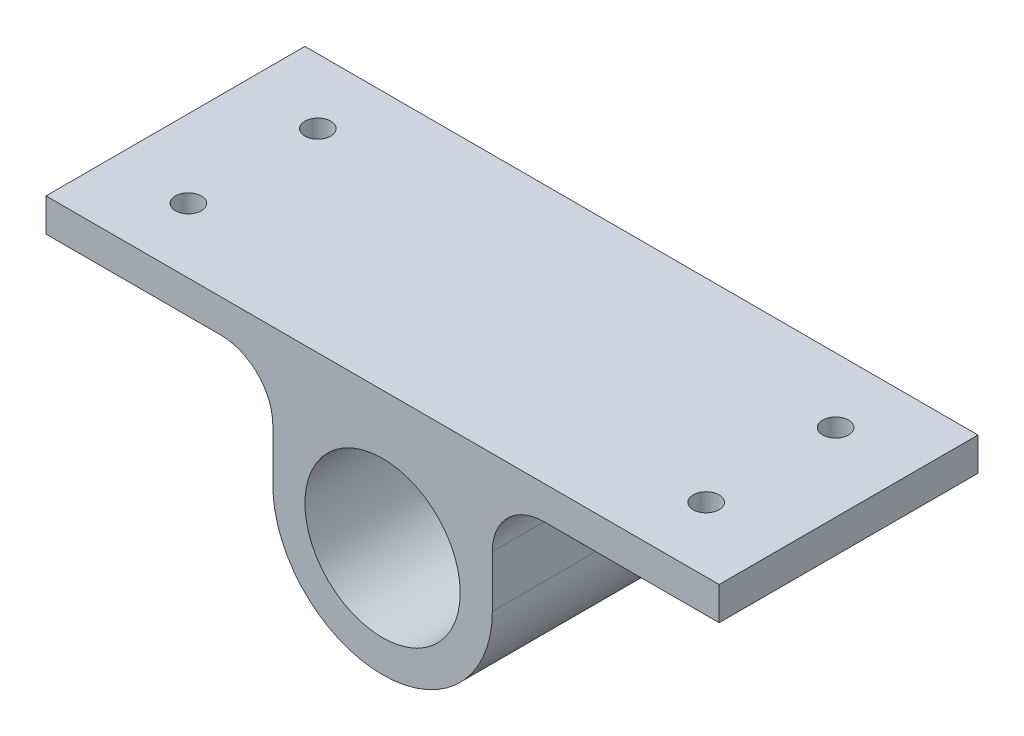
ISO-10303-21;
HEADER;
FILE_DESCRIPTION(('STEP AP214'),'2;1');
FILE_NAME('part.step','',(''),(''),'','','');
FILE_SCHEMA(('AUTOMOTIVE_DESIGN { 1 0 10303 214 1 1 1 1 }'));
ENDSEC;
DATA;
#1=APPLICATION_CONTEXT('core data for automotive mechanical design processes');
#2=APPLICATION_PROTOCOL_DEFINITION('international standard','automotive_design',2000,#1);
#3=PRODUCT_CONTEXT('',#1,'mechanical');
#4=PRODUCT('Part','Part','',(#3));
#5=PRODUCT_RELATED_PRODUCT_CATEGORY('part','',(#4));
#6=PRODUCT_DEFINITION_FORMATION('','',#4);
#7=PRODUCT_DEFINITION_CONTEXT('part definition',#1,'design');
#8=PRODUCT_DEFINITION('design','',#6,#7);
#9=PRODUCT_DEFINITION_SHAPE('','',#8);
#10=(LENGTH_UNIT() NAMED_UNIT(*) SI_UNIT(.MILLI.,.METRE.));
#11=(NAMED_UNIT(*) PLANE_ANGLE_UNIT() SI_UNIT($,.RADIAN.));
#12=(NAMED_UNIT(*) SI_UNIT($,.STERADIAN.) SOLID_ANGLE_UNIT());
#13=UNCERTAINTY_MEASURE_WITH_UNIT(LENGTH_MEASURE(1.E-05),#10,'distance_accuracy_value','');
#14=(GEOMETRIC_REPRESENTATION_CONTEXT(3) GLOBAL_UNCERTAINTY_ASSIGNED_CONTEXT((#13)) GLOBAL_UNIT_ASSIGNED_CONTEXT((#10,
#11,#12)) REPRESENTATION_CONTEXT('',''));
#15=CARTESIAN_POINT('',(0.,0.,0.));
#16=DIRECTION('',(0.,0.,1.));
#17=DIRECTION('',(1.,0.,0.));
#18=AXIS2_PLACEMENT_3D('',#15,#16,#17);
#19=CARTESIAN_POINT('',(-156.,50.,250.));
#20=DIRECTION('',(0.,0.,-1.));
#21=DIRECTION('',(-1.,0.,0.));
#22=AXIS2_PLACEMENT_3D('',#19,#20,#21);
#23=PLANE('',#22);
#24=DIRECTION('',(0.,-1.,0.));
#25=VECTOR('',#24,1.);
#26=CARTESIAN_POINT('',(-325.,132.,250.));
#27=LINE('',#26,#25);
#28=CARTESIAN_POINT('',(-325.,132.,250.));
#29=VERTEX_POINT('',#28);
#30=CARTESIAN_POINT('',(-325.,100.,250.));
#31=VERTEX_POINT('',#30);
#32=EDGE_CURVE('E165',#29,#31,#27,.T.);
#33=ORIENTED_EDGE('',*,*,#32,.T.);
#34=DIRECTION('',(1.,0.,0.));
#35=VECTOR('',#34,1.);
#36=CARTESIAN_POINT('',(-325.,100.,250.));
#37=LINE('',#36,#35);
#38=CARTESIAN_POINT('',(-156.,100.,250.));
#39=VERTEX_POINT('',#38);
#40=EDGE_CURVE('E103',#31,#39,#37,.T.);
#41=ORIENTED_EDGE('',*,*,#40,.T.);
#42=CARTESIAN_POINT('',(-156.,50.,250.));
#43=DIRECTION('',(0.,0.,-1.));
#44=DIRECTION('',(-1.,0.,0.));
#45=AXIS2_PLACEMENT_3D('',#42,#43,#44);
#46=CIRCLE('',#45,50.);
#47=CARTESIAN_POINT('',(-106.,49.9999999999997,250.));
#48=VERTEX_POINT('',#47);
#49=EDGE_CURVE('E186',#39,#48,#46,.T.);
#50=ORIENTED_EDGE('',*,*,#49,.T.);
#51=DIRECTION('',(0.,-1.,0.));
#52=VECTOR('',#51,1.);
#53=CARTESIAN_POINT('',(-106.,49.9999999999997,250.));
#54=LINE('',#53,#52);
#55=CARTESIAN_POINT('',(-106.,0.,250.));
#56=VERTEX_POINT('',#55);
#57=EDGE_CURVE('E205',#48,#56,#54,.T.);
#58=ORIENTED_EDGE('',*,*,#57,.T.);
#59=CARTESIAN_POINT('',(0.,0.,250.));
#60=DIRECTION('',(0.,0.,1.));
#61=DIRECTION('',(1.,0.,0.));
#62=AXIS2_PLACEMENT_3D('',#59,#60,#61);
#63=CIRCLE('',#62,106.);
#64=CARTESIAN_POINT('',(106.,0.,250.));
#65=VERTEX_POINT('',#64);
#66=EDGE_CURVE('E202',#56,#65,#63,.T.);
#67=ORIENTED_EDGE('',*,*,#66,.T.);
#68=DIRECTION('',(0.,1.,0.));
#69=VECTOR('',#68,1.);
#70=CARTESIAN_POINT('',(106.,49.9999999999996,250.));
#71=LINE('',#70,#69);
#72=CARTESIAN_POINT('',(106.,49.9999999999996,250.));
#73=VERTEX_POINT('',#72);
#74=EDGE_CURVE('E204',#65,#73,#71,.T.);
#75=ORIENTED_EDGE('',*,*,#74,.T.);
#76=CARTESIAN_POINT('',(156.,50.,250.));
#77=DIRECTION('',(0.,0.,-1.));
#78=DIRECTION('',(1.,0.,0.));
#79=AXIS2_PLACEMENT_3D('',#76,#77,#78);
#80=CIRCLE('',#79,50.);
#81=CARTESIAN_POINT('',(156.,100.,250.));
#82=VERTEX_POINT('',#81);
#83=EDGE_CURVE('E128',#73,#82,#80,.T.);
#84=ORIENTED_EDGE('',*,*,#83,.T.);
#85=DIRECTION('',(1.,0.,0.));
#86=VECTOR('',#85,1.);
#87=CARTESIAN_POINT('',(325.,100.,250.));
#88=LINE('',#87,#86);
#89=CARTESIAN_POINT('',(325.,100.,250.));
#90=VERTEX_POINT('',#89);
#91=EDGE_CURVE('E122',#82,#90,#88,.T.);
#92=ORIENTED_EDGE('',*,*,#91,.T.);
#93=DIRECTION('',(0.,1.,0.));
#94=VECTOR('',#93,1.);
#95=CARTESIAN_POINT('',(325.,132.,250.));
#96=LINE('',#95,#94);
#97=CARTESIAN_POINT('',(325.,132.,250.));
#98=VERTEX_POINT('',#97);
#99=EDGE_CURVE('E126',#90,#98,#96,.T.);
#100=ORIENTED_EDGE('',*,*,#99,.T.);
#101=DIRECTION('',(-1.,0.,0.));
#102=VECTOR('',#101,1.);
#103=CARTESIAN_POINT('',(-325.,132.,250.));
#104=LINE('',#103,#102);
#105=EDGE_CURVE('E54',#98,#29,#104,.T.);
#106=ORIENTED_EDGE('',*,*,#105,.T.);
#107=EDGE_LOOP('',(#33,#41,#50,#58,#67,#75,#84,#92,#100,#106));
#108=FACE_BOUND('',#107,.T.);
#109=CARTESIAN_POINT('',(0.,0.,250.));
#110=DIRECTION('',(0.,0.,1.));
#111=DIRECTION('',(1.,0.,0.));
#112=AXIS2_PLACEMENT_3D('',#109,#110,#111);
#113=CIRCLE('',#112,75.);
#114=CARTESIAN_POINT('',(75.,0.,250.));
#115=VERTEX_POINT('',#114);
#116=EDGE_CURVE('E150',#115,#115,#113,.T.);
#117=ORIENTED_EDGE('',*,*,#116,.F.);
#118=EDGE_LOOP('',(#117));
#119=FACE_BOUND('',#118,.T.);
#120=ADVANCED_FACE('F37',(#108,#119),#23,.F.);
#121=CARTESIAN_POINT('',(-156.,50.,0.));
#122=DIRECTION('',(0.,0.,-1.));
#123=DIRECTION('',(-1.,0.,0.));
#124=AXIS2_PLACEMENT_3D('',#121,#122,#123);
#125=PLANE('',#124);
#126=DIRECTION('',(0.,-1.,0.));
#127=VECTOR('',#126,1.);
#128=CARTESIAN_POINT('',(-325.,132.,0.));
#129=LINE('',#128,#127);
#130=CARTESIAN_POINT('',(-325.,132.,0.));
#131=VERTEX_POINT('',#130);
#132=CARTESIAN_POINT('',(-325.,100.,0.));
#133=VERTEX_POINT('',#132);
#134=EDGE_CURVE('E146',#131,#133,#129,.T.);
#135=ORIENTED_EDGE('',*,*,#134,.F.);
#136=DIRECTION('',(-1.,0.,0.));
#137=VECTOR('',#136,1.);
#138=CARTESIAN_POINT('',(-325.,132.,0.));
#139=LINE('',#138,#137);
#140=CARTESIAN_POINT('',(325.,132.,0.));
#141=VERTEX_POINT('',#140);
#142=EDGE_CURVE('E95',#141,#131,#139,.T.);
#143=ORIENTED_EDGE('',*,*,#142,.F.);
#144=DIRECTION('',(0.,1.,0.));
#145=VECTOR('',#144,1.);
#146=CARTESIAN_POINT('',(325.,132.,0.));
#147=LINE('',#146,#145);
#148=CARTESIAN_POINT('',(325.,100.,0.));
#149=VERTEX_POINT('',#148);
#150=EDGE_CURVE('E89',#149,#141,#147,.T.);
#151=ORIENTED_EDGE('',*,*,#150,.F.);
#152=DIRECTION('',(1.,0.,0.));
#153=VECTOR('',#152,1.);
#154=CARTESIAN_POINT('',(325.,100.,0.));
#155=LINE('',#154,#153);
#156=CARTESIAN_POINT('',(156.,100.,0.));
#157=VERTEX_POINT('',#156);
#158=EDGE_CURVE('E136',#157,#149,#155,.T.);
#159=ORIENTED_EDGE('',*,*,#158,.F.);
#160=CARTESIAN_POINT('',(156.,50.,0.));
#161=DIRECTION('',(0.,0.,-1.));
#162=DIRECTION('',(1.,0.,0.));
#163=AXIS2_PLACEMENT_3D('',#160,#161,#162);
#164=CIRCLE('',#163,50.);
#165=CARTESIAN_POINT('',(106.,49.9999999999996,0.));
#166=VERTEX_POINT('',#165);
#167=EDGE_CURVE('E160',#166,#157,#164,.T.);
#168=ORIENTED_EDGE('',*,*,#167,.F.);
#169=DIRECTION('',(0.,1.,0.));
#170=VECTOR('',#169,1.);
#171=CARTESIAN_POINT('',(106.,49.9999999999996,0.));
#172=LINE('',#171,#170);
#173=CARTESIAN_POINT('',(106.,0.,0.));
#174=VERTEX_POINT('',#173);
#175=EDGE_CURVE('E158',#174,#166,#172,.T.);
#176=ORIENTED_EDGE('',*,*,#175,.F.);
#177=CARTESIAN_POINT('',(0.,0.,0.));
#178=DIRECTION('',(0.,0.,1.));
#179=DIRECTION('',(1.,0.,0.));
#180=AXIS2_PLACEMENT_3D('',#177,#178,#179);
#181=CIRCLE('',#180,106.);
#182=CARTESIAN_POINT('',(-106.,0.,0.));
#183=VERTEX_POINT('',#182);
#184=EDGE_CURVE('E156',#183,#174,#181,.T.);
#185=ORIENTED_EDGE('',*,*,#184,.F.);
#186=DIRECTION('',(0.,-1.,0.));
#187=VECTOR('',#186,1.);
#188=CARTESIAN_POINT('',(-106.,49.9999999999997,0.));
#189=LINE('',#188,#187);
#190=CARTESIAN_POINT('',(-106.,49.9999999999997,0.));
#191=VERTEX_POINT('',#190);
#192=EDGE_CURVE('E154',#191,#183,#189,.T.);
#193=ORIENTED_EDGE('',*,*,#192,.F.);
#194=CARTESIAN_POINT('',(-156.,50.,0.));
#195=DIRECTION('',(0.,0.,-1.));
#196=DIRECTION('',(-1.,0.,0.));
#197=AXIS2_PLACEMENT_3D('',#194,#195,#196);
#198=CIRCLE('',#197,50.);
#199=CARTESIAN_POINT('',(-156.,100.,0.));
#200=VERTEX_POINT('',#199);
#201=EDGE_CURVE('E152',#200,#191,#198,.T.);
#202=ORIENTED_EDGE('',*,*,#201,.F.);
#203=DIRECTION('',(1.,0.,0.));
#204=VECTOR('',#203,1.);
#205=CARTESIAN_POINT('',(-325.,100.,0.));
#206=LINE('',#205,#204);
#207=EDGE_CURVE('E149',#133,#200,#206,.T.);
#208=ORIENTED_EDGE('',*,*,#207,.F.);
#209=EDGE_LOOP('',(#135,#143,#151,#159,#168,#176,#185,#193,#202,#208));
#210=FACE_BOUND('',#209,.T.);
#211=CARTESIAN_POINT('',(0.,0.,0.));
#212=DIRECTION('',(0.,0.,1.));
#213=DIRECTION('',(1.,0.,0.));
#214=AXIS2_PLACEMENT_3D('',#211,#212,#213);
#215=CIRCLE('',#214,75.);
#216=CARTESIAN_POINT('',(75.,0.,0.));
#217=VERTEX_POINT('',#216);
#218=EDGE_CURVE('E213',#217,#217,#215,.T.);
#219=ORIENTED_EDGE('',*,*,#218,.T.);
#220=EDGE_LOOP('',(#219));
#221=FACE_BOUND('',#220,.T.);
#222=ADVANCED_FACE('F190',(#210,#221),#125,.T.);
#223=CARTESIAN_POINT('',(-325.,132.,250.));
#224=DIRECTION('',(1.,0.,0.));
#225=DIRECTION('',(0.,0.,-1.));
#226=AXIS2_PLACEMENT_3D('',#223,#224,#225);
#227=PLANE('',#226);
#228=ORIENTED_EDGE('',*,*,#134,.T.);
#229=DIRECTION('',(0.,0.,-1.));
#230=VECTOR('',#229,1.);
#231=CARTESIAN_POINT('',(-325.,100.,250.));
#232=LINE('',#231,#230);
#233=EDGE_CURVE('E11',#31,#133,#232,.T.);
#234=ORIENTED_EDGE('',*,*,#233,.F.);
#235=ORIENTED_EDGE('',*,*,#32,.F.);
#236=DIRECTION('',(0.,0.,-1.));
#237=VECTOR('',#236,1.);
#238=CARTESIAN_POINT('',(-325.,132.,250.));
#239=LINE('',#238,#237);
#240=EDGE_CURVE('E142',#29,#131,#239,.T.);
#241=ORIENTED_EDGE('',*,*,#240,.T.);
#242=EDGE_LOOP('',(#228,#234,#235,#241));
#243=FACE_BOUND('',#242,.T.);
#244=ADVANCED_FACE('F39',(#243),#227,.F.);
#245=CARTESIAN_POINT('',(-325.,100.,250.));
#246=DIRECTION('',(0.,1.,0.));
#247=DIRECTION('',(0.,0.,1.));
#248=AXIS2_PLACEMENT_3D('',#245,#246,#247);
#249=PLANE('',#248);
#250=CARTESIAN_POINT('',(-250.,100.,187.5));
#251=DIRECTION('',(0.,1.,0.));
#252=DIRECTION('',(0.,0.,1.));
#253=AXIS2_PLACEMENT_3D('',#250,#251,#252);
#254=CIRCLE('',#253,12.5);
#255=CARTESIAN_POINT('',(-250.,100.,200.));
#256=VERTEX_POINT('',#255);
#257=EDGE_CURVE('E228',#256,#256,#254,.T.);
#258=ORIENTED_EDGE('',*,*,#257,.T.);
#259=EDGE_LOOP('',(#258));
#260=FACE_BOUND('',#259,.T.);
#261=CARTESIAN_POINT('',(-250.,100.,62.5));
#262=DIRECTION('',(0.,1.,0.));
#263=DIRECTION('',(0.,0.,1.));
#264=AXIS2_PLACEMENT_3D('',#261,#262,#263);
#265=CIRCLE('',#264,12.5);
#266=CARTESIAN_POINT('',(-250.,100.,75.));
#267=VERTEX_POINT('',#266);
#268=EDGE_CURVE('E219',#267,#267,#265,.T.);
#269=ORIENTED_EDGE('',*,*,#268,.T.);
#270=EDGE_LOOP('',(#269));
#271=FACE_BOUND('',#270,.T.);
#272=ORIENTED_EDGE('',*,*,#207,.T.);
#273=DIRECTION('',(0.,0.,-1.));
#274=VECTOR('',#273,1.);
#275=CARTESIAN_POINT('',(-156.,100.,250.));
#276=LINE('',#275,#274);
#277=EDGE_CURVE('E46',#39,#200,#276,.T.);
#278=ORIENTED_EDGE('',*,*,#277,.F.);
#279=ORIENTED_EDGE('',*,*,#40,.F.);
#280=ORIENTED_EDGE('',*,*,#233,.T.);
#281=EDGE_LOOP('',(#272,#278,#279,#280));
#282=FACE_BOUND('',#281,.T.);
#283=ADVANCED_FACE('F290',(#260,#271,#282),#249,.F.);
#284=CARTESIAN_POINT('',(-156.,50.,250.));
#285=DIRECTION('',(0.,0.,-1.));
#286=DIRECTION('',(-1.,0.,0.));
#287=AXIS2_PLACEMENT_3D('',#284,#285,#286);
#288=CYLINDRICAL_SURFACE('',#287,50.);
#289=ORIENTED_EDGE('',*,*,#201,.T.);
#290=DIRECTION('',(0.,0.,-1.));
#291=VECTOR('',#290,1.);
#292=CARTESIAN_POINT('',(-106.,49.9999999999997,250.));
#293=LINE('',#292,#291);
#294=EDGE_CURVE('E178',#48,#191,#293,.T.);
#295=ORIENTED_EDGE('',*,*,#294,.F.);
#296=ORIENTED_EDGE('',*,*,#49,.F.);
#297=ORIENTED_EDGE('',*,*,#277,.T.);
#298=EDGE_LOOP('',(#289,#295,#296,#297));
#299=FACE_BOUND('',#298,.T.);
#300=ADVANCED_FACE('F184',(#299),#288,.F.);
#301=CARTESIAN_POINT('',(-106.,49.9999999999997,250.));
#302=DIRECTION('',(1.,0.,0.));
#303=DIRECTION('',(0.,0.,-1.));
#304=AXIS2_PLACEMENT_3D('',#301,#302,#303);
#305=PLANE('',#304);
#306=ORIENTED_EDGE('',*,*,#192,.T.);
#307=DIRECTION('',(0.,0.,-1.));
#308=VECTOR('',#307,1.);
#309=CARTESIAN_POINT('',(-106.,0.,250.));
#310=LINE('',#309,#308);
#311=EDGE_CURVE('E175',#56,#183,#310,.T.);
#312=ORIENTED_EDGE('',*,*,#311,.F.);
#313=ORIENTED_EDGE('',*,*,#57,.F.);
#314=ORIENTED_EDGE('',*,*,#294,.T.);
#315=EDGE_LOOP('',(#306,#312,#313,#314));
#316=FACE_BOUND('',#315,.T.);
#317=ADVANCED_FACE('F196',(#316),#305,.F.);
#318=CARTESIAN_POINT('',(0.,0.,250.));
#319=DIRECTION('',(0.,0.,-1.));
#320=DIRECTION('',(-1.,0.,0.));
#321=AXIS2_PLACEMENT_3D('',#318,#319,#320);
#322=CYLINDRICAL_SURFACE('',#321,106.);
#323=ORIENTED_EDGE('',*,*,#184,.T.);
#324=DIRECTION('',(0.,0.,-1.));
#325=VECTOR('',#324,1.);
#326=CARTESIAN_POINT('',(106.,0.,250.));
#327=LINE('',#326,#325);
#328=EDGE_CURVE('E172',#65,#174,#327,.T.);
#329=ORIENTED_EDGE('',*,*,#328,.F.);
#330=ORIENTED_EDGE('',*,*,#66,.F.);
#331=ORIENTED_EDGE('',*,*,#311,.T.);
#332=EDGE_LOOP('',(#323,#329,#330,#331));
#333=FACE_BOUND('',#332,.T.);
#334=ADVANCED_FACE('F200',(#333),#322,.T.);
#335=CARTESIAN_POINT('',(106.,49.9999999999996,250.));
#336=DIRECTION('',(-1.,0.,0.));
#337=DIRECTION('',(0.,0.,1.));
#338=AXIS2_PLACEMENT_3D('',#335,#336,#337);
#339=PLANE('',#338);
#340=ORIENTED_EDGE('',*,*,#175,.T.);
#341=DIRECTION('',(0.,0.,-1.));
#342=VECTOR('',#341,1.);
#343=CARTESIAN_POINT('',(106.,49.9999999999996,250.));
#344=LINE('',#343,#342);
#345=EDGE_CURVE('E169',#73,#166,#344,.T.);
#346=ORIENTED_EDGE('',*,*,#345,.F.);
#347=ORIENTED_EDGE('',*,*,#74,.F.);
#348=ORIENTED_EDGE('',*,*,#328,.T.);
#349=EDGE_LOOP('',(#340,#346,#347,#348));
#350=FACE_BOUND('',#349,.T.);
#351=ADVANCED_FACE('F280',(#350),#339,.F.);
#352=CARTESIAN_POINT('',(156.,50.,250.));
#353=DIRECTION('',(0.,0.,-1.));
#354=DIRECTION('',(-1.,0.,0.));
#355=AXIS2_PLACEMENT_3D('',#352,#353,#354);
#356=CYLINDRICAL_SURFACE('',#355,50.);
#357=ORIENTED_EDGE('',*,*,#167,.T.);
#358=DIRECTION('',(0.,0.,-1.));
#359=VECTOR('',#358,1.);
#360=CARTESIAN_POINT('',(156.,100.,250.));
#361=LINE('',#360,#359);
#362=EDGE_CURVE('E137',#82,#157,#361,.T.);
#363=ORIENTED_EDGE('',*,*,#362,.F.);
#364=ORIENTED_EDGE('',*,*,#83,.F.);
#365=ORIENTED_EDGE('',*,*,#345,.T.);
#366=EDGE_LOOP('',(#357,#363,#364,#365));
#367=FACE_BOUND('',#366,.T.);
#368=ADVANCED_FACE('F276',(#367),#356,.F.);
#369=CARTESIAN_POINT('',(325.,100.,250.));
#370=DIRECTION('',(0.,1.,0.));
#371=DIRECTION('',(-1.,0.,0.));
#372=AXIS2_PLACEMENT_3D('',#369,#370,#371);
#373=PLANE('',#372);
#374=CARTESIAN_POINT('',(250.,100.,187.5));
#375=DIRECTION('',(0.,1.,0.));
#376=DIRECTION('',(0.,0.,1.));
#377=AXIS2_PLACEMENT_3D('',#374,#375,#376);
#378=CIRCLE('',#377,12.5);
#379=CARTESIAN_POINT('',(250.,100.,200.));
#380=VERTEX_POINT('',#379);
#381=EDGE_CURVE('E234',#380,#380,#378,.T.);
#382=ORIENTED_EDGE('',*,*,#381,.T.);
#383=EDGE_LOOP('',(#382));
#384=FACE_BOUND('',#383,.T.);
#385=CARTESIAN_POINT('',(250.,100.,62.5));
#386=DIRECTION('',(0.,1.,0.));
#387=DIRECTION('',(0.,0.,1.));
#388=AXIS2_PLACEMENT_3D('',#385,#386,#387);
#389=CIRCLE('',#388,12.5);
#390=CARTESIAN_POINT('',(250.,100.,75.));
#391=VERTEX_POINT('',#390);
#392=EDGE_CURVE('E222',#391,#391,#389,.T.);
#393=ORIENTED_EDGE('',*,*,#392,.T.);
#394=EDGE_LOOP('',(#393));
#395=FACE_BOUND('',#394,.T.);
#396=ORIENTED_EDGE('',*,*,#158,.T.);
#397=DIRECTION('',(0.,0.,-1.));
#398=VECTOR('',#397,1.);
#399=CARTESIAN_POINT('',(325.,100.,250.));
#400=LINE('',#399,#398);
#401=EDGE_CURVE('E133',#90,#149,#400,.T.);
#402=ORIENTED_EDGE('',*,*,#401,.F.);
#403=ORIENTED_EDGE('',*,*,#91,.F.);
#404=ORIENTED_EDGE('',*,*,#362,.T.);
#405=EDGE_LOOP('',(#396,#402,#403,#404));
#406=FACE_BOUND('',#405,.T.);
#407=ADVANCED_FACE('F134',(#384,#395,#406),#373,.F.);
#408=CARTESIAN_POINT('',(325.,132.,250.));
#409=DIRECTION('',(-1.,0.,0.));
#410=DIRECTION('',(0.,0.,1.));
#411=AXIS2_PLACEMENT_3D('',#408,#409,#410);
#412=PLANE('',#411);
#413=ORIENTED_EDGE('',*,*,#150,.T.);
#414=DIRECTION('',(0.,0.,-1.));
#415=VECTOR('',#414,1.);
#416=CARTESIAN_POINT('',(325.,132.,250.));
#417=LINE('',#416,#415);
#418=EDGE_CURVE('E138',#98,#141,#417,.T.);
#419=ORIENTED_EDGE('',*,*,#418,.F.);
#420=ORIENTED_EDGE('',*,*,#99,.F.);
#421=ORIENTED_EDGE('',*,*,#401,.T.);
#422=EDGE_LOOP('',(#413,#419,#420,#421));
#423=FACE_BOUND('',#422,.T.);
#424=ADVANCED_FACE('F140',(#423),#412,.F.);
#425=CARTESIAN_POINT('',(-325.,132.,250.));
#426=DIRECTION('',(0.,-1.,0.));
#427=DIRECTION('',(0.,0.,-1.));
#428=AXIS2_PLACEMENT_3D('',#425,#426,#427);
#429=PLANE('',#428);
#430=CARTESIAN_POINT('',(-250.,132.,187.5));
#431=DIRECTION('',(0.,1.,0.));
#432=DIRECTION('',(0.,0.,1.));
#433=AXIS2_PLACEMENT_3D('',#430,#431,#432);
#434=CIRCLE('',#433,12.5);
#435=CARTESIAN_POINT('',(-250.,132.,200.));
#436=VERTEX_POINT('',#435);
#437=EDGE_CURVE('E225',#436,#436,#434,.T.);
#438=ORIENTED_EDGE('',*,*,#437,.F.);
#439=EDGE_LOOP('',(#438));
#440=FACE_BOUND('',#439,.T.);
#441=CARTESIAN_POINT('',(250.,132.,187.5));
#442=DIRECTION('',(0.,1.,0.));
#443=DIRECTION('',(0.,0.,1.));
#444=AXIS2_PLACEMENT_3D('',#441,#442,#443);
#445=CIRCLE('',#444,12.5);
#446=CARTESIAN_POINT('',(250.,132.,200.));
#447=VERTEX_POINT('',#446);
#448=EDGE_CURVE('E231',#447,#447,#445,.T.);
#449=ORIENTED_EDGE('',*,*,#448,.F.);
#450=EDGE_LOOP('',(#449));
#451=FACE_BOUND('',#450,.T.);
#452=CARTESIAN_POINT('',(250.,132.,62.5));
#453=DIRECTION('',(0.,1.,0.));
#454=DIRECTION('',(0.,0.,1.));
#455=AXIS2_PLACEMENT_3D('',#452,#453,#454);
#456=CIRCLE('',#455,12.5);
#457=CARTESIAN_POINT('',(250.,132.,75.));
#458=VERTEX_POINT('',#457);
#459=EDGE_CURVE('E237',#458,#458,#456,.T.);
#460=ORIENTED_EDGE('',*,*,#459,.F.);
#461=EDGE_LOOP('',(#460));
#462=FACE_BOUND('',#461,.T.);
#463=CARTESIAN_POINT('',(-250.,132.,62.5));
#464=DIRECTION('',(0.,1.,0.));
#465=DIRECTION('',(0.,0.,1.));
#466=AXIS2_PLACEMENT_3D('',#463,#464,#465);
#467=CIRCLE('',#466,12.5);
#468=CARTESIAN_POINT('',(-250.,132.,75.));
#469=VERTEX_POINT('',#468);
#470=EDGE_CURVE('E216',#469,#469,#467,.T.);
#471=ORIENTED_EDGE('',*,*,#470,.F.);
#472=EDGE_LOOP('',(#471));
#473=FACE_BOUND('',#472,.T.);
#474=ORIENTED_EDGE('',*,*,#142,.T.);
#475=ORIENTED_EDGE('',*,*,#240,.F.);
#476=ORIENTED_EDGE('',*,*,#105,.F.);
#477=ORIENTED_EDGE('',*,*,#418,.T.);
#478=EDGE_LOOP('',(#474,#475,#476,#477));
#479=FACE_BOUND('',#478,.T.);
#480=ADVANCED_FACE('F268',(#440,#451,#462,#473,#479),#429,.F.);
#481=CARTESIAN_POINT('',(0.,0.,250.));
#482=DIRECTION('',(0.,0.,-1.));
#483=DIRECTION('',(-1.,0.,0.));
#484=AXIS2_PLACEMENT_3D('',#481,#482,#483);
#485=CYLINDRICAL_SURFACE('',#484,75.);
#486=ORIENTED_EDGE('',*,*,#116,.T.);
#487=EDGE_LOOP('',(#486));
#488=FACE_BOUND('',#487,.T.);
#489=ORIENTED_EDGE('',*,*,#218,.F.);
#490=EDGE_LOOP('',(#489));
#491=FACE_BOUND('',#490,.T.);
#492=ADVANCED_FACE('F257',(#488,#491),#485,.F.);
#493=CARTESIAN_POINT('',(-250.,132.,62.5));
#494=DIRECTION('',(0.,-1.,0.));
#495=DIRECTION('',(0.,0.,-1.));
#496=AXIS2_PLACEMENT_3D('',#493,#494,#495);
#497=CYLINDRICAL_SURFACE('',#496,12.5);
#498=ORIENTED_EDGE('',*,*,#470,.T.);
#499=EDGE_LOOP('',(#498));
#500=FACE_BOUND('',#499,.T.);
#501=ORIENTED_EDGE('',*,*,#268,.F.);
#502=EDGE_LOOP('',(#501));
#503=FACE_BOUND('',#502,.T.);
#504=ADVANCED_FACE('F247',(#500,#503),#497,.F.);
#505=CARTESIAN_POINT('',(250.,132.,62.5));
#506=DIRECTION('',(0.,-1.,0.));
#507=DIRECTION('',(0.,0.,-1.));
#508=AXIS2_PLACEMENT_3D('',#505,#506,#507);
#509=CYLINDRICAL_SURFACE('',#508,12.5);
#510=ORIENTED_EDGE('',*,*,#459,.T.);
#511=EDGE_LOOP('',(#510));
#512=FACE_BOUND('',#511,.T.);
#513=ORIENTED_EDGE('',*,*,#392,.F.);
#514=EDGE_LOOP('',(#513));
#515=FACE_BOUND('',#514,.T.);
#516=ADVANCED_FACE('F244',(#512,#515),#509,.F.);
#517=CARTESIAN_POINT('',(250.,132.,187.5));
#518=DIRECTION('',(0.,-1.,0.));
#519=DIRECTION('',(0.,0.,-1.));
#520=AXIS2_PLACEMENT_3D('',#517,#518,#519);
#521=CYLINDRICAL_SURFACE('',#520,12.5);
#522=ORIENTED_EDGE('',*,*,#448,.T.);
#523=EDGE_LOOP('',(#522));
#524=FACE_BOUND('',#523,.T.);
#525=ORIENTED_EDGE('',*,*,#381,.F.);
#526=EDGE_LOOP('',(#525));
#527=FACE_BOUND('',#526,.T.);
#528=ADVANCED_FACE('F246',(#524,#527),#521,.F.);
#529=CARTESIAN_POINT('',(-250.,132.,187.5));
#530=DIRECTION('',(0.,-1.,0.));
#531=DIRECTION('',(0.,0.,-1.));
#532=AXIS2_PLACEMENT_3D('',#529,#530,#531);
#533=CYLINDRICAL_SURFACE('',#532,12.5);
#534=ORIENTED_EDGE('',*,*,#437,.T.);
#535=EDGE_LOOP('',(#534));
#536=FACE_BOUND('',#535,.T.);
#537=ORIENTED_EDGE('',*,*,#257,.F.);
#538=EDGE_LOOP('',(#537));
#539=FACE_BOUND('',#538,.T.);
#540=ADVANCED_FACE('F254',(#536,#539),#533,.F.);
#541=CLOSED_SHELL('',(#120,#222,#244,#283,#300,#317,#334,#351,#368,#407,#424,#480,#492,#504,
#516,#528,#540));
#542=MANIFOLD_SOLID_BREP('B2',#541);
#543=ADVANCED_BREP_SHAPE_REPRESENTATION('',(#18,#542),#14);
#544=SHAPE_DEFINITION_REPRESENTATION(#9,#543);
ENDSEC;
END-ISO-10303-21;
